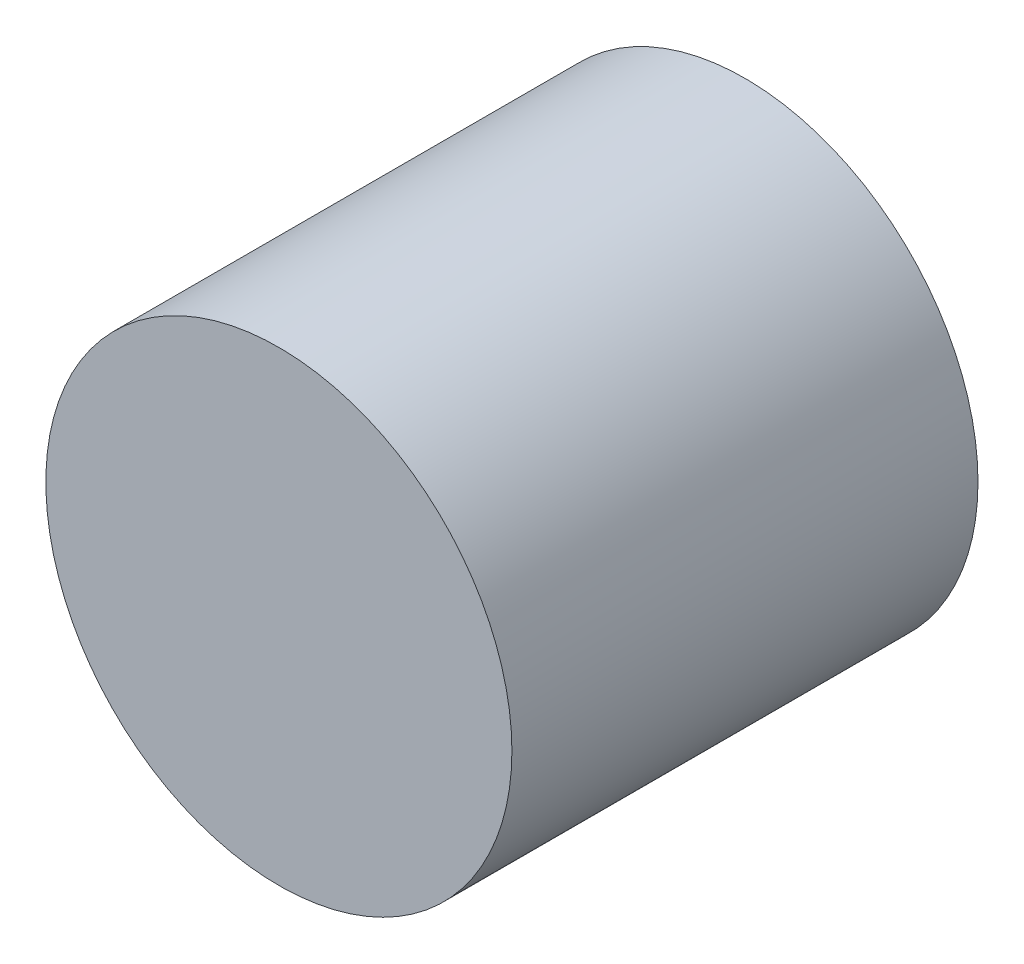
ISO-10303-21;
HEADER;
FILE_DESCRIPTION(('STEP AP214'),'2;1');
FILE_NAME('part.step','',(''),(''),'','','');
FILE_SCHEMA(('AUTOMOTIVE_DESIGN { 1 0 10303 214 1 1 1 1 }'));
ENDSEC;
DATA;
#1=APPLICATION_CONTEXT('core data for automotive mechanical design processes');
#2=APPLICATION_PROTOCOL_DEFINITION('international standard','automotive_design',2000,#1);
#3=PRODUCT_CONTEXT('',#1,'mechanical');
#4=PRODUCT('Part','Part','',(#3));
#5=PRODUCT_RELATED_PRODUCT_CATEGORY('part','',(#4));
#6=PRODUCT_DEFINITION_FORMATION('','',#4);
#7=PRODUCT_DEFINITION_CONTEXT('part definition',#1,'design');
#8=PRODUCT_DEFINITION('design','',#6,#7);
#9=PRODUCT_DEFINITION_SHAPE('','',#8);
#10=(LENGTH_UNIT() NAMED_UNIT(*) SI_UNIT(.MILLI.,.METRE.));
#11=(NAMED_UNIT(*) PLANE_ANGLE_UNIT() SI_UNIT($,.RADIAN.));
#12=(NAMED_UNIT(*) SI_UNIT($,.STERADIAN.) SOLID_ANGLE_UNIT());
#13=UNCERTAINTY_MEASURE_WITH_UNIT(LENGTH_MEASURE(1.E-05),#10,'distance_accuracy_value','');
#14=(GEOMETRIC_REPRESENTATION_CONTEXT(3) GLOBAL_UNCERTAINTY_ASSIGNED_CONTEXT((#13)) GLOBAL_UNIT_ASSIGNED_CONTEXT((#10,
#11,#12)) REPRESENTATION_CONTEXT('',''));
#15=CARTESIAN_POINT('',(0.,0.,0.));
#16=DIRECTION('',(0.,0.,1.));
#17=DIRECTION('',(1.,0.,0.));
#18=AXIS2_PLACEMENT_3D('',#15,#16,#17);
#19=CARTESIAN_POINT('',(-57.9853517021394,22.2098086124402,6.));
#20=DIRECTION('',(0.,0.,-1.));
#21=DIRECTION('',(-1.,0.,0.));
#22=AXIS2_PLACEMENT_3D('',#19,#20,#21);
#23=CYLINDRICAL_SURFACE('',#22,3.);
#24=CARTESIAN_POINT('',(-57.9853517021394,22.2098086124402,6.));
#25=DIRECTION('',(0.,0.,1.));
#26=DIRECTION('',(1.,0.,0.));
#27=AXIS2_PLACEMENT_3D('',#24,#25,#26);
#28=CIRCLE('',#27,3.);
#29=CARTESIAN_POINT('',(-54.9853517021394,22.2098086124402,6.));
#30=VERTEX_POINT('',#29);
#31=EDGE_CURVE('E10',#30,#30,#28,.T.);
#32=ORIENTED_EDGE('',*,*,#31,.F.);
#33=EDGE_LOOP('',(#32));
#34=FACE_BOUND('',#33,.T.);
#35=CARTESIAN_POINT('',(-57.9853517021394,22.2098086124402,0.));
#36=DIRECTION('',(0.,0.,1.));
#37=DIRECTION('',(1.,0.,0.));
#38=AXIS2_PLACEMENT_3D('',#35,#36,#37);
#39=CIRCLE('',#38,3.);
#40=CARTESIAN_POINT('',(-54.9853517021394,22.2098086124402,0.));
#41=VERTEX_POINT('',#40);
#42=EDGE_CURVE('E34',#41,#41,#39,.T.);
#43=ORIENTED_EDGE('',*,*,#42,.T.);
#44=EDGE_LOOP('',(#43));
#45=FACE_BOUND('',#44,.T.);
#46=ADVANCED_FACE('F31',(#34,#45),#23,.T.);
#47=CARTESIAN_POINT('',(-57.9853517021394,22.2098086124402,6.));
#48=DIRECTION('',(0.,0.,1.));
#49=DIRECTION('',(1.,0.,0.));
#50=AXIS2_PLACEMENT_3D('',#47,#48,#49);
#51=PLANE('',#50);
#52=ORIENTED_EDGE('',*,*,#31,.T.);
#53=EDGE_LOOP('',(#52));
#54=FACE_BOUND('',#53,.T.);
#55=ADVANCED_FACE('F46',(#54),#51,.T.);
#56=CARTESIAN_POINT('',(-57.9853517021394,22.2098086124402,0.));
#57=DIRECTION('',(0.,0.,1.));
#58=DIRECTION('',(1.,0.,0.));
#59=AXIS2_PLACEMENT_3D('',#56,#57,#58);
#60=PLANE('',#59);
#61=ORIENTED_EDGE('',*,*,#42,.F.);
#62=EDGE_LOOP('',(#61));
#63=FACE_BOUND('',#62,.T.);
#64=ADVANCED_FACE('F44',(#63),#60,.F.);
#65=CLOSED_SHELL('',(#46,#55,#64));
#66=MANIFOLD_SOLID_BREP('B2',#65);
#67=ADVANCED_BREP_SHAPE_REPRESENTATION('',(#18,#66),#14);
#68=SHAPE_DEFINITION_REPRESENTATION(#9,#67);
ENDSEC;
END-ISO-10303-21;
